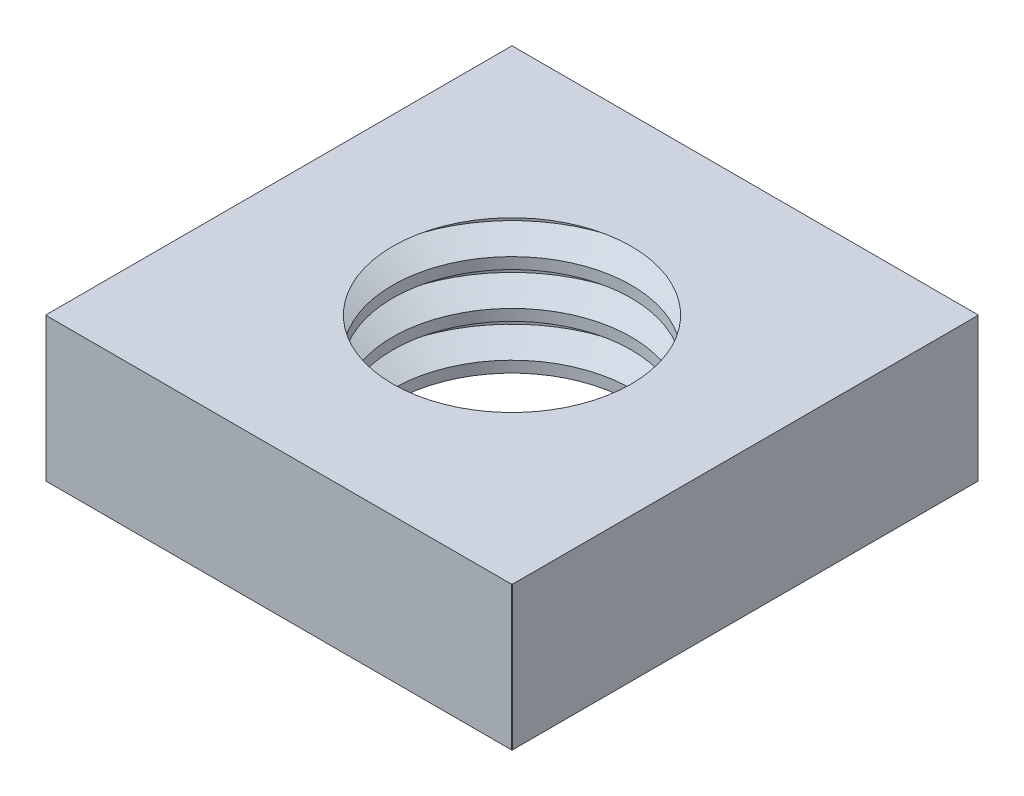
ISO-10303-21;
HEADER;
FILE_DESCRIPTION(('STEP AP214'),'2;1');
FILE_NAME('part.step','',(''),(''),'','','');
FILE_SCHEMA(('AUTOMOTIVE_DESIGN { 1 0 10303 214 1 1 1 1 }'));
ENDSEC;
DATA;
#1=APPLICATION_CONTEXT('core data for automotive mechanical design processes');
#2=APPLICATION_PROTOCOL_DEFINITION('international standard','automotive_design',2000,#1);
#3=PRODUCT_CONTEXT('',#1,'mechanical');
#4=PRODUCT('Part','Part','',(#3));
#5=PRODUCT_RELATED_PRODUCT_CATEGORY('part','',(#4));
#6=PRODUCT_DEFINITION_FORMATION('','',#4);
#7=PRODUCT_DEFINITION_CONTEXT('part definition',#1,'design');
#8=PRODUCT_DEFINITION('design','',#6,#7);
#9=PRODUCT_DEFINITION_SHAPE('','',#8);
#10=(LENGTH_UNIT() NAMED_UNIT(*) SI_UNIT(.MILLI.,.METRE.));
#11=(NAMED_UNIT(*) PLANE_ANGLE_UNIT() SI_UNIT($,.RADIAN.));
#12=(NAMED_UNIT(*) SI_UNIT($,.STERADIAN.) SOLID_ANGLE_UNIT());
#13=UNCERTAINTY_MEASURE_WITH_UNIT(LENGTH_MEASURE(1.E-05),#10,'distance_accuracy_value','');
#14=(GEOMETRIC_REPRESENTATION_CONTEXT(3) GLOBAL_UNCERTAINTY_ASSIGNED_CONTEXT((#13)) GLOBAL_UNIT_ASSIGNED_CONTEXT((#10,
#11,#12)) REPRESENTATION_CONTEXT('',''));
#15=CARTESIAN_POINT('',(0.,0.,0.));
#16=DIRECTION('',(0.,0.,1.));
#17=DIRECTION('',(1.,0.,0.));
#18=AXIS2_PLACEMENT_3D('',#15,#16,#17);
#19=CARTESIAN_POINT('',(0.,-2.08642145901571,0.));
#20=DIRECTION('',(0.,1.,0.));
#21=DIRECTION('',(0.,0.,1.));
#22=AXIS2_PLACEMENT_3D('',#19,#20,#21);
#23=CYLINDRICAL_SURFACE('',#22,3.3234176532934);
#24=CARTESIAN_POINT('',(0.,1.81250000002819,0.));
#25=DIRECTION('',(0.,1.,0.));
#26=DIRECTION('',(0.,0.,1.));
#27=AXIS2_PLACEMENT_3D('',#24,#25,#26);
#28=CIRCLE('',#27,3.32341765329147);
#29=CARTESIAN_POINT('',(0.,1.8125000000141,3.32341765329244));
#30=VERTEX_POINT('',#29);
#31=EDGE_CURVE('E162',#30,#30,#28,.T.);
#32=ORIENTED_EDGE('',*,*,#31,.T.);
#33=EDGE_LOOP('',(#32));
#34=FACE_BOUND('',#33,.T.);
#35=CARTESIAN_POINT('',(0.,1.50000000081718,0.));
#36=DIRECTION('',(0.,-1.,0.));
#37=DIRECTION('',(0.,0.,-1.));
#38=AXIS2_PLACEMENT_3D('',#35,#36,#37);
#39=CIRCLE('',#38,3.32341765380306);
#40=CARTESIAN_POINT('',(0.,1.50000000040859,-3.32341765354823));
#41=VERTEX_POINT('',#40);
#42=EDGE_CURVE('E32',#41,#41,#39,.T.);
#43=ORIENTED_EDGE('',*,*,#42,.T.);
#44=EDGE_LOOP('',(#43));
#45=FACE_BOUND('',#44,.T.);
#46=ADVANCED_FACE('F15',(#34,#45),#23,.F.);
#47=CARTESIAN_POINT('',(0.,1.10937500016917,0.));
#48=DIRECTION('',(0.,-1.,0.));
#49=DIRECTION('',(0.,0.,-1.));
#50=AXIS2_PLACEMENT_3D('',#47,#48,#49);
#51=CONICAL_SURFACE('',#50,3.99999999979173,1.04719755000191);
#52=CARTESIAN_POINT('',(0.,1.109375,0.));
#53=DIRECTION('',(0.,1.,0.));
#54=DIRECTION('',(0.,0.,1.));
#55=AXIS2_PLACEMENT_3D('',#52,#53,#54);
#56=CIRCLE('',#55,4.);
#57=CARTESIAN_POINT('',(0.,1.10937500002774,4.00000000000955));
#58=VERTEX_POINT('',#57);
#59=EDGE_CURVE('E157',#58,#58,#56,.F.);
#60=ORIENTED_EDGE('',*,*,#59,.T.);
#61=EDGE_LOOP('',(#60));
#62=FACE_BOUND('',#61,.T.);
#63=ORIENTED_EDGE('',*,*,#42,.F.);
#64=EDGE_LOOP('',(#63));
#65=FACE_BOUND('',#64,.T.);
#66=ADVANCED_FACE('F334',(#62,#65),#51,.F.);
#67=CARTESIAN_POINT('',(0.,2.20312500073305,0.));
#68=DIRECTION('',(0.,1.,0.));
#69=DIRECTION('',(0.,0.,1.));
#70=AXIS2_PLACEMENT_3D('',#67,#68,#69);
#71=CONICAL_SURFACE('',#70,3.99999999939382,1.04719755002854);
#72=CARTESIAN_POINT('',(0.,2.203125,0.));
#73=DIRECTION('',(0.,1.,0.));
#74=DIRECTION('',(0.,0.,1.));
#75=AXIS2_PLACEMENT_3D('',#72,#73,#74);
#76=CIRCLE('',#75,4.);
#77=CARTESIAN_POINT('',(0.,2.20312500039495,3.99999999972533));
#78=VERTEX_POINT('',#77);
#79=EDGE_CURVE('E151',#78,#78,#76,.T.);
#80=ORIENTED_EDGE('',*,*,#79,.T.);
#81=EDGE_LOOP('',(#80));
#82=FACE_BOUND('',#81,.T.);
#83=ORIENTED_EDGE('',*,*,#31,.F.);
#84=EDGE_LOOP('',(#83));
#85=FACE_BOUND('',#84,.T.);
#86=ADVANCED_FACE('F331',(#82,#85),#71,.F.);
#87=CARTESIAN_POINT('',(0.,-3.33642145901571,0.));
#88=DIRECTION('',(0.,1.,0.));
#89=DIRECTION('',(0.,0.,1.));
#90=AXIS2_PLACEMENT_3D('',#87,#88,#89);
#91=CYLINDRICAL_SURFACE('',#90,4.);
#92=ORIENTED_EDGE('',*,*,#59,.F.);
#93=EDGE_LOOP('',(#92));
#94=FACE_BOUND('',#93,.T.);
#95=CARTESIAN_POINT('',(0.,0.953125000819455,0.));
#96=DIRECTION('',(0.,1.,0.));
#97=DIRECTION('',(0.,0.,1.));
#98=AXIS2_PLACEMENT_3D('',#95,#96,#97);
#99=CIRCLE('',#98,3.99999999956435);
#100=CARTESIAN_POINT('',(0.,0.953125000409728,3.99999999978218));
#101=VERTEX_POINT('',#100);
#102=EDGE_CURVE('E146',#101,#101,#99,.F.);
#103=ORIENTED_EDGE('',*,*,#102,.T.);
#104=EDGE_LOOP('',(#103));
#105=FACE_BOUND('',#104,.T.);
#106=ADVANCED_FACE('F327',(#94,#105),#91,.F.);
#107=CARTESIAN_POINT('',(0.,-2.08642145901571,0.));
#108=DIRECTION('',(0.,1.,0.));
#109=DIRECTION('',(0.,0.,1.));
#110=AXIS2_PLACEMENT_3D('',#107,#108,#109);
#111=CYLINDRICAL_SURFACE('',#110,4.);
#112=CARTESIAN_POINT('',(0.,2.35937500002592,0.));
#113=DIRECTION('',(0.,-1.,0.));
#114=DIRECTION('',(0.,0.,-1.));
#115=AXIS2_PLACEMENT_3D('',#112,#113,#114);
#116=CIRCLE('',#115,4.00000000007594);
#117=CARTESIAN_POINT('',(0.,2.35937500001296,4.00000000003797));
#118=VERTEX_POINT('',#117);
#119=EDGE_CURVE('E140',#118,#118,#116,.F.);
#120=ORIENTED_EDGE('',*,*,#119,.T.);
#121=EDGE_LOOP('',(#120));
#122=FACE_BOUND('',#121,.T.);
#123=ORIENTED_EDGE('',*,*,#79,.F.);
#124=EDGE_LOOP('',(#123));
#125=FACE_BOUND('',#124,.T.);
#126=ADVANCED_FACE('F323',(#122,#125),#111,.F.);
#127=CARTESIAN_POINT('',(0.,0.953125000819455,0.));
#128=DIRECTION('',(0.,1.,0.));
#129=DIRECTION('',(-1.,0.,0.));
#130=AXIS2_PLACEMENT_3D('',#127,#128,#129);
#131=CONICAL_SURFACE('',#130,3.99999999956435,1.04719755001165);
#132=ORIENTED_EDGE('',*,*,#102,.F.);
#133=EDGE_LOOP('',(#132));
#134=FACE_BOUND('',#133,.T.);
#135=CARTESIAN_POINT('',(0.,0.5625,0.));
#136=DIRECTION('',(0.,1.,0.));
#137=DIRECTION('',(0.,0.,1.));
#138=AXIS2_PLACEMENT_3D('',#135,#136,#137);
#139=CIRCLE('',#138,3.3234176532934);
#140=CARTESIAN_POINT('',(0.,0.562500000000455,3.32341765329244));
#141=VERTEX_POINT('',#140);
#142=EDGE_CURVE('E134',#141,#141,#139,.F.);
#143=ORIENTED_EDGE('',*,*,#142,.T.);
#144=EDGE_LOOP('',(#143));
#145=FACE_BOUND('',#144,.T.);
#146=ADVANCED_FACE('F319',(#134,#145),#131,.F.);
#147=CARTESIAN_POINT('',(0.,2.35937500013961,0.));
#148=DIRECTION('',(0.,-1.,0.));
#149=DIRECTION('',(0.,0.,-1.));
#150=AXIS2_PLACEMENT_3D('',#147,#148,#149);
#151=CONICAL_SURFACE('',#150,3.99999999990541,1.04719755001165);
#152=ORIENTED_EDGE('',*,*,#119,.F.);
#153=EDGE_LOOP('',(#152));
#154=FACE_BOUND('',#153,.T.);
#155=CARTESIAN_POINT('',(0.,2.75,0.));
#156=DIRECTION('',(0.,1.,0.));
#157=DIRECTION('',(0.,0.,1.));
#158=AXIS2_PLACEMENT_3D('',#155,#156,#157);
#159=CIRCLE('',#158,3.3234176532934);
#160=CARTESIAN_POINT('',(0.,2.75000000042223,-3.32341765354823));
#161=VERTEX_POINT('',#160);
#162=EDGE_CURVE('E129',#161,#161,#159,.T.);
#163=ORIENTED_EDGE('',*,*,#162,.T.);
#164=EDGE_LOOP('',(#163));
#165=FACE_BOUND('',#164,.T.);
#166=ADVANCED_FACE('F316',(#154,#165),#151,.F.);
#167=CARTESIAN_POINT('',(0.,-3.33642145901571,0.));
#168=DIRECTION('',(0.,1.,0.));
#169=DIRECTION('',(0.,0.,1.));
#170=AXIS2_PLACEMENT_3D('',#167,#168,#169);
#171=CYLINDRICAL_SURFACE('',#170,3.3234176532934);
#172=ORIENTED_EDGE('',*,*,#142,.F.);
#173=EDGE_LOOP('',(#172));
#174=FACE_BOUND('',#173,.T.);
#175=CARTESIAN_POINT('',(0.,0.25000000084674,0.));
#176=DIRECTION('',(0.,-1.,0.));
#177=DIRECTION('',(0.,0.,-1.));
#178=AXIS2_PLACEMENT_3D('',#175,#176,#177);
#179=CIRCLE('',#178,3.32341765380306);
#180=CARTESIAN_POINT('',(0.,0.250000000423369,-3.32341765354823));
#181=VERTEX_POINT('',#180);
#182=EDGE_CURVE('E133',#181,#181,#179,.T.);
#183=ORIENTED_EDGE('',*,*,#182,.T.);
#184=EDGE_LOOP('',(#183));
#185=FACE_BOUND('',#184,.T.);
#186=ADVANCED_FACE('F313',(#174,#185),#171,.F.);
#187=CARTESIAN_POINT('',(0.,-0.836421459015707,0.));
#188=DIRECTION('',(0.,1.,0.));
#189=DIRECTION('',(0.,0.,1.));
#190=AXIS2_PLACEMENT_3D('',#187,#188,#189);
#191=CYLINDRICAL_SURFACE('',#190,3.3234176532934);
#192=CARTESIAN_POINT('',(0.,3.06249999999864,0.));
#193=DIRECTION('',(0.,1.,0.));
#194=DIRECTION('',(0.,0.,1.));
#195=AXIS2_PLACEMENT_3D('',#192,#193,#194);
#196=CIRCLE('',#195,3.32341765329147);
#197=CARTESIAN_POINT('',(0.,3.06249999999932,3.32341765329244));
#198=VERTEX_POINT('',#197);
#199=EDGE_CURVE('E104',#198,#198,#196,.T.);
#200=ORIENTED_EDGE('',*,*,#199,.T.);
#201=EDGE_LOOP('',(#200));
#202=FACE_BOUND('',#201,.T.);
#203=ORIENTED_EDGE('',*,*,#162,.F.);
#204=EDGE_LOOP('',(#203));
#205=FACE_BOUND('',#204,.T.);
#206=ADVANCED_FACE('F292',(#202,#205),#191,.F.);
#207=CARTESIAN_POINT('',(0.,4.54747350886464E-10,0.));
#208=DIRECTION('',(0.,-1.,0.));
#209=DIRECTION('',(0.,0.,-1.));
#210=AXIS2_PLACEMENT_3D('',#207,#208,#209);
#211=CONICAL_SURFACE('',#210,3.75643035522444,1.04719755002042);
#212=CARTESIAN_POINT('',(0.,3.56291661076194E-10,0.));
#213=DIRECTION('',(0.,-1.,0.));
#214=DIRECTION('',(0.,0.,-1.));
#215=AXIS2_PLACEMENT_3D('',#212,#213,#214);
#216=CIRCLE('',#215,3.75643035539497);
#217=CARTESIAN_POINT('',(0.,3.56291661076194E-10,-3.75643035539497));
#218=VERTEX_POINT('',#217);
#219=EDGE_CURVE('E178',#218,#218,#216,.T.);
#220=ORIENTED_EDGE('',*,*,#219,.T.);
#221=EDGE_LOOP('',(#220));
#222=FACE_BOUND('',#221,.T.);
#223=ORIENTED_EDGE('',*,*,#182,.F.);
#224=EDGE_LOOP('',(#223));
#225=FACE_BOUND('',#224,.T.);
#226=ADVANCED_FACE('F299',(#222,#225),#211,.F.);
#227=CARTESIAN_POINT('',(0.,3.45312500081718,0.));
#228=DIRECTION('',(0.,1.,0.));
#229=DIRECTION('',(-1.,0.,0.));
#230=AXIS2_PLACEMENT_3D('',#227,#228,#229);
#231=CONICAL_SURFACE('',#230,3.99999999956435,1.04719755001165);
#232=CARTESIAN_POINT('',(0.,3.453125,0.));
#233=DIRECTION('',(0.,1.,0.));
#234=DIRECTION('',(0.,0.,1.));
#235=AXIS2_PLACEMENT_3D('',#232,#233,#234);
#236=CIRCLE('',#235,4.);
#237=CARTESIAN_POINT('',(0.,3.45312500040859,3.99999999978218));
#238=VERTEX_POINT('',#237);
#239=EDGE_CURVE('E113',#238,#238,#236,.T.);
#240=ORIENTED_EDGE('',*,*,#239,.T.);
#241=EDGE_LOOP('',(#240));
#242=FACE_BOUND('',#241,.T.);
#243=ORIENTED_EDGE('',*,*,#199,.F.);
#244=EDGE_LOOP('',(#243));
#245=FACE_BOUND('',#244,.T.);
#246=ADVANCED_FACE('F297',(#242,#245),#231,.F.);
#247=CARTESIAN_POINT('',(0.,5.48106432943272,0.));
#248=DIRECTION('',(0.,1.,0.));
#249=DIRECTION('',(0.,0.,1.));
#250=AXIS2_PLACEMENT_3D('',#247,#248,#249);
#251=CYLINDRICAL_SURFACE('',#250,9.18238815542514);
#252=CARTESIAN_POINT('',(0.,0.,0.));
#253=DIRECTION('',(0.,1.,0.));
#254=DIRECTION('',(0.,0.,1.));
#255=AXIS2_PLACEMENT_3D('',#252,#253,#254);
#256=CIRCLE('',#255,9.18238815542514);
#257=CARTESIAN_POINT('',(6.50000000000001,0.,-6.48585015529128));
#258=VERTEX_POINT('',#257);
#259=CARTESIAN_POINT('',(6.48585015529125,0.,-6.50000000000003));
#260=VERTEX_POINT('',#259);
#261=EDGE_CURVE('E185',#258,#260,#256,.T.);
#262=ORIENTED_EDGE('',*,*,#261,.T.);
#263=DIRECTION('',(0.,1.,0.));
#264=VECTOR('',#263,1.);
#265=CARTESIAN_POINT('',(6.48585015529125,6.5,-6.50000000000003));
#266=LINE('',#265,#264);
#267=CARTESIAN_POINT('',(6.48585015529125,4.,-6.50000000000003));
#268=VERTEX_POINT('',#267);
#269=EDGE_CURVE('E101',#260,#268,#266,.T.);
#270=ORIENTED_EDGE('',*,*,#269,.T.);
#271=CARTESIAN_POINT('',(0.,4.,0.));
#272=DIRECTION('',(0.,1.,0.));
#273=DIRECTION('',(0.,0.,1.));
#274=AXIS2_PLACEMENT_3D('',#271,#272,#273);
#275=CIRCLE('',#274,9.18238815542514);
#276=CARTESIAN_POINT('',(6.5,4.,-6.48585015529128));
#277=VERTEX_POINT('',#276);
#278=EDGE_CURVE('E18',#268,#277,#275,.F.);
#279=ORIENTED_EDGE('',*,*,#278,.T.);
#280=DIRECTION('',(0.,1.,0.));
#281=VECTOR('',#280,1.);
#282=CARTESIAN_POINT('',(6.50000000000001,6.5,-6.48585015529128));
#283=LINE('',#282,#281);
#284=EDGE_CURVE('E98',#277,#258,#283,.F.);
#285=ORIENTED_EDGE('',*,*,#284,.T.);
#286=EDGE_LOOP('',(#262,#270,#279,#285));
#287=FACE_BOUND('',#286,.T.);
#288=ADVANCED_FACE('F97',(#287),#251,.T.);
#289=CARTESIAN_POINT('',(0.,5.48106432943272,0.));
#290=DIRECTION('',(0.,1.,0.));
#291=DIRECTION('',(0.,0.,1.));
#292=AXIS2_PLACEMENT_3D('',#289,#290,#291);
#293=CYLINDRICAL_SURFACE('',#292,9.18238815542514);
#294=CARTESIAN_POINT('',(0.,0.,0.));
#295=DIRECTION('',(0.,1.,0.));
#296=DIRECTION('',(0.,0.,1.));
#297=AXIS2_PLACEMENT_3D('',#294,#295,#296);
#298=CIRCLE('',#297,9.18238815542514);
#299=CARTESIAN_POINT('',(-6.48585015529125,0.,-6.50000000000003));
#300=VERTEX_POINT('',#299);
#301=CARTESIAN_POINT('',(-6.50000000000001,0.,-6.48585015529128));
#302=VERTEX_POINT('',#301);
#303=EDGE_CURVE('E183',#300,#302,#298,.T.);
#304=ORIENTED_EDGE('',*,*,#303,.T.);
#305=DIRECTION('',(0.,1.,0.));
#306=VECTOR('',#305,1.);
#307=CARTESIAN_POINT('',(-6.50000000000001,6.5,-6.48585015529128));
#308=LINE('',#307,#306);
#309=CARTESIAN_POINT('',(-6.5,4.,-6.48585015529128));
#310=VERTEX_POINT('',#309);
#311=EDGE_CURVE('E194',#302,#310,#308,.T.);
#312=ORIENTED_EDGE('',*,*,#311,.T.);
#313=CARTESIAN_POINT('',(0.,4.,0.));
#314=DIRECTION('',(0.,1.,0.));
#315=DIRECTION('',(0.,0.,1.));
#316=AXIS2_PLACEMENT_3D('',#313,#314,#315);
#317=CIRCLE('',#316,9.18238815542514);
#318=CARTESIAN_POINT('',(-6.48585015529125,4.,-6.50000000000003));
#319=VERTEX_POINT('',#318);
#320=EDGE_CURVE('E103',#310,#319,#317,.F.);
#321=ORIENTED_EDGE('',*,*,#320,.T.);
#322=DIRECTION('',(0.,1.,0.));
#323=VECTOR('',#322,1.);
#324=CARTESIAN_POINT('',(-6.48585015529125,6.5,-6.50000000000003));
#325=LINE('',#324,#323);
#326=EDGE_CURVE('E191',#319,#300,#325,.F.);
#327=ORIENTED_EDGE('',*,*,#326,.T.);
#328=EDGE_LOOP('',(#304,#312,#321,#327));
#329=FACE_BOUND('',#328,.T.);
#330=ADVANCED_FACE('F190',(#329),#293,.T.);
#331=CARTESIAN_POINT('',(0.,5.48106432943272,0.));
#332=DIRECTION('',(0.,1.,0.));
#333=DIRECTION('',(0.,0.,1.));
#334=AXIS2_PLACEMENT_3D('',#331,#332,#333);
#335=CYLINDRICAL_SURFACE('',#334,9.18238815542514);
#336=CARTESIAN_POINT('',(0.,0.,0.));
#337=DIRECTION('',(0.,1.,0.));
#338=DIRECTION('',(0.,0.,1.));
#339=AXIS2_PLACEMENT_3D('',#336,#337,#338);
#340=CIRCLE('',#339,9.18238815542514);
#341=CARTESIAN_POINT('',(6.48585015529131,0.,6.49999999999997));
#342=VERTEX_POINT('',#341);
#343=CARTESIAN_POINT('',(6.50000000000001,0.,6.48585015529128));
#344=VERTEX_POINT('',#343);
#345=EDGE_CURVE('E181',#342,#344,#340,.T.);
#346=ORIENTED_EDGE('',*,*,#345,.T.);
#347=DIRECTION('',(0.,1.,0.));
#348=VECTOR('',#347,1.);
#349=CARTESIAN_POINT('',(6.50000000000001,6.5,6.48585015529128));
#350=LINE('',#349,#348);
#351=CARTESIAN_POINT('',(6.5,4.,6.48585015529128));
#352=VERTEX_POINT('',#351);
#353=EDGE_CURVE('E202',#344,#352,#350,.T.);
#354=ORIENTED_EDGE('',*,*,#353,.T.);
#355=CARTESIAN_POINT('',(0.,4.,0.));
#356=DIRECTION('',(0.,1.,0.));
#357=DIRECTION('',(0.,0.,1.));
#358=AXIS2_PLACEMENT_3D('',#355,#356,#357);
#359=CIRCLE('',#358,9.18238815542514);
#360=CARTESIAN_POINT('',(6.48585015529131,4.,6.49999999999997));
#361=VERTEX_POINT('',#360);
#362=EDGE_CURVE('E117',#352,#361,#359,.F.);
#363=ORIENTED_EDGE('',*,*,#362,.T.);
#364=DIRECTION('',(0.,1.,0.));
#365=VECTOR('',#364,1.);
#366=CARTESIAN_POINT('',(6.48585015529131,6.5,6.49999999999997));
#367=LINE('',#366,#365);
#368=EDGE_CURVE('E208',#361,#342,#367,.F.);
#369=ORIENTED_EDGE('',*,*,#368,.T.);
#370=EDGE_LOOP('',(#346,#354,#363,#369));
#371=FACE_BOUND('',#370,.T.);
#372=ADVANCED_FACE('F235',(#371),#335,.T.);
#373=CARTESIAN_POINT('',(6.50000000000001,0.,-6.50000000000003));
#374=DIRECTION('',(0.,1.,0.));
#375=DIRECTION('',(0.,0.,1.));
#376=AXIS2_PLACEMENT_3D('',#373,#374,#375);
#377=PLANE('',#376);
#378=ORIENTED_EDGE('',*,*,#219,.F.);
#379=EDGE_LOOP('',(#378));
#380=FACE_BOUND('',#379,.T.);
#381=DIRECTION('',(-1.,0.,0.));
#382=VECTOR('',#381,1.);
#383=CARTESIAN_POINT('',(-6.5,0.,6.49999999999997));
#384=LINE('',#383,#382);
#385=CARTESIAN_POINT('',(-6.48585015529131,0.,6.49999999999997));
#386=VERTEX_POINT('',#385);
#387=EDGE_CURVE('E210',#342,#386,#384,.T.);
#388=ORIENTED_EDGE('',*,*,#387,.T.);
#389=CARTESIAN_POINT('',(0.,0.,0.));
#390=DIRECTION('',(0.,1.,0.));
#391=DIRECTION('',(0.,0.,1.));
#392=AXIS2_PLACEMENT_3D('',#389,#390,#391);
#393=CIRCLE('',#392,9.18238815542514);
#394=CARTESIAN_POINT('',(-6.50000000000001,0.,6.48585015529128));
#395=VERTEX_POINT('',#394);
#396=EDGE_CURVE('E173',#395,#386,#393,.T.);
#397=ORIENTED_EDGE('',*,*,#396,.F.);
#398=DIRECTION('',(0.,0.,-1.));
#399=VECTOR('',#398,1.);
#400=CARTESIAN_POINT('',(-6.50000000000001,0.,-6.50000000000003));
#401=LINE('',#400,#399);
#402=EDGE_CURVE('E209',#395,#302,#401,.T.);
#403=ORIENTED_EDGE('',*,*,#402,.T.);
#404=ORIENTED_EDGE('',*,*,#303,.F.);
#405=DIRECTION('',(1.,0.,0.));
#406=VECTOR('',#405,1.);
#407=CARTESIAN_POINT('',(-6.50000000000001,0.,-6.50000000000003));
#408=LINE('',#407,#406);
#409=EDGE_CURVE('E201',#300,#260,#408,.T.);
#410=ORIENTED_EDGE('',*,*,#409,.T.);
#411=ORIENTED_EDGE('',*,*,#261,.F.);
#412=DIRECTION('',(0.,0.,1.));
#413=VECTOR('',#412,1.);
#414=CARTESIAN_POINT('',(6.50000000000001,0.,6.49999999999997));
#415=LINE('',#414,#413);
#416=EDGE_CURVE('E112',#258,#344,#415,.T.);
#417=ORIENTED_EDGE('',*,*,#416,.T.);
#418=ORIENTED_EDGE('',*,*,#345,.F.);
#419=EDGE_LOOP('',(#388,#397,#403,#404,#410,#411,#417,#418));
#420=FACE_BOUND('',#419,.T.);
#421=ADVANCED_FACE('F232',(#380,#420),#377,.F.);
#422=CARTESIAN_POINT('',(0.,5.48106432943272,0.));
#423=DIRECTION('',(0.,1.,0.));
#424=DIRECTION('',(0.,0.,1.));
#425=AXIS2_PLACEMENT_3D('',#422,#423,#424);
#426=CYLINDRICAL_SURFACE('',#425,9.18238815542514);
#427=ORIENTED_EDGE('',*,*,#396,.T.);
#428=DIRECTION('',(0.,1.,0.));
#429=VECTOR('',#428,1.);
#430=CARTESIAN_POINT('',(-6.48585015529131,6.5,6.49999999999997));
#431=LINE('',#430,#429);
#432=CARTESIAN_POINT('',(-6.48585015529131,4.,6.49999999999997));
#433=VERTEX_POINT('',#432);
#434=EDGE_CURVE('E125',#386,#433,#431,.T.);
#435=ORIENTED_EDGE('',*,*,#434,.T.);
#436=CARTESIAN_POINT('',(0.,4.,0.));
#437=DIRECTION('',(0.,1.,0.));
#438=DIRECTION('',(0.,0.,1.));
#439=AXIS2_PLACEMENT_3D('',#436,#437,#438);
#440=CIRCLE('',#439,9.18238815542514);
#441=CARTESIAN_POINT('',(-6.5,4.,6.48585015529128));
#442=VERTEX_POINT('',#441);
#443=EDGE_CURVE('E176',#433,#442,#440,.F.);
#444=ORIENTED_EDGE('',*,*,#443,.T.);
#445=DIRECTION('',(0.,1.,0.));
#446=VECTOR('',#445,1.);
#447=CARTESIAN_POINT('',(-6.50000000000001,6.5,6.48585015529128));
#448=LINE('',#447,#446);
#449=EDGE_CURVE('E213',#442,#395,#448,.F.);
#450=ORIENTED_EDGE('',*,*,#449,.T.);
#451=EDGE_LOOP('',(#427,#435,#444,#450));
#452=FACE_BOUND('',#451,.T.);
#453=ADVANCED_FACE('F243',(#452),#426,.T.);
#454=CARTESIAN_POINT('',(0.,-0.836421459015707,0.));
#455=DIRECTION('',(0.,1.,0.));
#456=DIRECTION('',(0.,0.,1.));
#457=AXIS2_PLACEMENT_3D('',#454,#455,#456);
#458=CYLINDRICAL_SURFACE('',#457,4.);
#459=CARTESIAN_POINT('',(0.,3.60937500005321,0.));
#460=DIRECTION('',(0.,-1.,0.));
#461=DIRECTION('',(0.,0.,-1.));
#462=AXIS2_PLACEMENT_3D('',#459,#460,#461);
#463=CIRCLE('',#462,4.0000000000191);
#464=CARTESIAN_POINT('',(0.,3.6093750000266,4.00000000000955));
#465=VERTEX_POINT('',#464);
#466=EDGE_CURVE('E120',#465,#465,#463,.F.);
#467=ORIENTED_EDGE('',*,*,#466,.T.);
#468=EDGE_LOOP('',(#467));
#469=FACE_BOUND('',#468,.T.);
#470=ORIENTED_EDGE('',*,*,#239,.F.);
#471=EDGE_LOOP('',(#470));
#472=FACE_BOUND('',#471,.T.);
#473=ADVANCED_FACE('F272',(#469,#472),#458,.F.);
#474=CARTESIAN_POINT('',(6.50000000000001,6.5,6.49999999999997));
#475=DIRECTION('',(-1.,0.,0.));
#476=DIRECTION('',(0.,0.,1.));
#477=AXIS2_PLACEMENT_3D('',#474,#475,#476);
#478=PLANE('',#477);
#479=ORIENTED_EDGE('',*,*,#353,.F.);
#480=ORIENTED_EDGE('',*,*,#416,.F.);
#481=ORIENTED_EDGE('',*,*,#284,.F.);
#482=DIRECTION('',(0.,0.,1.));
#483=VECTOR('',#482,1.);
#484=CARTESIAN_POINT('',(6.5,4.,0.468809563507646));
#485=LINE('',#484,#483);
#486=EDGE_CURVE('E110',#352,#277,#485,.F.);
#487=ORIENTED_EDGE('',*,*,#486,.F.);
#488=EDGE_LOOP('',(#479,#480,#481,#487));
#489=FACE_BOUND('',#488,.T.);
#490=ADVANCED_FACE('F109',(#489),#478,.F.);
#491=CARTESIAN_POINT('',(-6.50000000000001,6.5,-6.50000000000003));
#492=DIRECTION('',(0.,0.,1.));
#493=DIRECTION('',(1.,0.,0.));
#494=AXIS2_PLACEMENT_3D('',#491,#492,#493);
#495=PLANE('',#494);
#496=ORIENTED_EDGE('',*,*,#269,.F.);
#497=ORIENTED_EDGE('',*,*,#409,.F.);
#498=ORIENTED_EDGE('',*,*,#326,.F.);
#499=DIRECTION('',(1.,0.,0.));
#500=VECTOR('',#499,1.);
#501=CARTESIAN_POINT('',(2.59573116573093,4.,-6.50000000000003));
#502=LINE('',#501,#500);
#503=EDGE_CURVE('E119',#268,#319,#502,.F.);
#504=ORIENTED_EDGE('',*,*,#503,.F.);
#505=EDGE_LOOP('',(#496,#497,#498,#504));
#506=FACE_BOUND('',#505,.T.);
#507=ADVANCED_FACE('F199',(#506),#495,.F.);
#508=CARTESIAN_POINT('',(-6.50000000000001,6.5,-6.50000000000003));
#509=DIRECTION('',(1.,0.,0.));
#510=DIRECTION('',(0.,0.,-1.));
#511=AXIS2_PLACEMENT_3D('',#508,#509,#510);
#512=PLANE('',#511);
#513=ORIENTED_EDGE('',*,*,#311,.F.);
#514=ORIENTED_EDGE('',*,*,#402,.F.);
#515=ORIENTED_EDGE('',*,*,#449,.F.);
#516=DIRECTION('',(0.,0.,1.));
#517=VECTOR('',#516,1.);
#518=CARTESIAN_POINT('',(-6.5,4.,0.468809563507646));
#519=LINE('',#518,#517);
#520=EDGE_CURVE('E122',#310,#442,#519,.T.);
#521=ORIENTED_EDGE('',*,*,#520,.F.);
#522=EDGE_LOOP('',(#513,#514,#515,#521));
#523=FACE_BOUND('',#522,.T.);
#524=ADVANCED_FACE('F245',(#523),#512,.F.);
#525=CARTESIAN_POINT('',(-6.5,6.5,6.49999999999997));
#526=DIRECTION('',(0.,0.,-1.));
#527=DIRECTION('',(-1.,0.,0.));
#528=AXIS2_PLACEMENT_3D('',#525,#526,#527);
#529=PLANE('',#528);
#530=ORIENTED_EDGE('',*,*,#434,.F.);
#531=ORIENTED_EDGE('',*,*,#387,.F.);
#532=ORIENTED_EDGE('',*,*,#368,.F.);
#533=DIRECTION('',(1.,0.,0.));
#534=VECTOR('',#533,1.);
#535=CARTESIAN_POINT('',(2.59573116573093,4.,6.49999999999997));
#536=LINE('',#535,#534);
#537=EDGE_CURVE('E25',#433,#361,#536,.T.);
#538=ORIENTED_EDGE('',*,*,#537,.F.);
#539=EDGE_LOOP('',(#530,#531,#532,#538));
#540=FACE_BOUND('',#539,.T.);
#541=ADVANCED_FACE('F240',(#540),#529,.F.);
#542=CARTESIAN_POINT('',(0.,3.60937500016689,0.));
#543=DIRECTION('',(0.,-1.,0.));
#544=DIRECTION('',(1.,0.,0.));
#545=AXIS2_PLACEMENT_3D('',#542,#543,#544);
#546=CONICAL_SURFACE('',#545,3.99999999979173,1.04719755000191);
#547=ORIENTED_EDGE('',*,*,#466,.F.);
#548=EDGE_LOOP('',(#547));
#549=FACE_BOUND('',#548,.T.);
#550=CARTESIAN_POINT('',(0.,4.00000000083014,0.));
#551=DIRECTION('',(0.,-1.,0.));
#552=DIRECTION('',(1.,0.,0.));
#553=AXIS2_PLACEMENT_3D('',#550,#551,#552);
#554=CIRCLE('',#553,3.32341765380306);
#555=CARTESIAN_POINT('',(0.,4.00000000083014,-3.32341765380306));
#556=VERTEX_POINT('',#555);
#557=EDGE_CURVE('E9',#556,#556,#554,.T.);
#558=ORIENTED_EDGE('',*,*,#557,.F.);
#559=EDGE_LOOP('',(#558));
#560=FACE_BOUND('',#559,.T.);
#561=ADVANCED_FACE('F254',(#549,#560),#546,.F.);
#562=CARTESIAN_POINT('',(2.59573116573093,4.,0.468809563507646));
#563=DIRECTION('',(0.,1.,0.));
#564=DIRECTION('',(0.,0.,1.));
#565=AXIS2_PLACEMENT_3D('',#562,#563,#564);
#566=PLANE('',#565);
#567=ORIENTED_EDGE('',*,*,#557,.T.);
#568=EDGE_LOOP('',(#567));
#569=FACE_BOUND('',#568,.T.);
#570=ORIENTED_EDGE('',*,*,#537,.T.);
#571=ORIENTED_EDGE('',*,*,#362,.F.);
#572=ORIENTED_EDGE('',*,*,#486,.T.);
#573=ORIENTED_EDGE('',*,*,#278,.F.);
#574=ORIENTED_EDGE('',*,*,#503,.T.);
#575=ORIENTED_EDGE('',*,*,#320,.F.);
#576=ORIENTED_EDGE('',*,*,#520,.T.);
#577=ORIENTED_EDGE('',*,*,#443,.F.);
#578=EDGE_LOOP('',(#570,#571,#572,#573,#574,#575,#576,#577));
#579=FACE_BOUND('',#578,.T.);
#580=ADVANCED_FACE('F116',(#569,#579),#566,.T.);
#581=CLOSED_SHELL('',(#46,#66,#86,#106,#126,#146,#166,#186,#206,#226,#246,#288,#330,#372,#421,
#453,#473,#490,#507,#524,#541,#561,#580));
#582=MANIFOLD_SOLID_BREP('B1',#581);
#583=ADVANCED_BREP_SHAPE_REPRESENTATION('',(#18,#582),#14);
#584=SHAPE_DEFINITION_REPRESENTATION(#9,#583);
ENDSEC;
END-ISO-10303-21;
